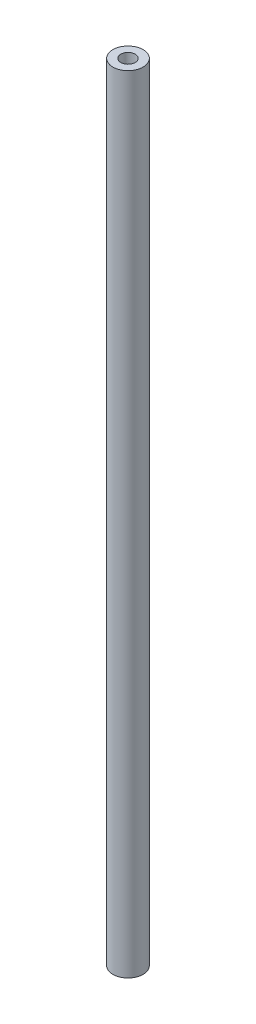
ISO-10303-21;
HEADER;
FILE_DESCRIPTION(('STEP AP214'),'2;1');
FILE_NAME('part.step','',(''),(''),'','','');
FILE_SCHEMA(('AUTOMOTIVE_DESIGN { 1 0 10303 214 1 1 1 1 }'));
ENDSEC;
DATA;
#1=APPLICATION_CONTEXT('core data for automotive mechanical design processes');
#2=APPLICATION_PROTOCOL_DEFINITION('international standard','automotive_design',2000,#1);
#3=PRODUCT_CONTEXT('',#1,'mechanical');
#4=PRODUCT('Part','Part','',(#3));
#5=PRODUCT_RELATED_PRODUCT_CATEGORY('part','',(#4));
#6=PRODUCT_DEFINITION_FORMATION('','',#4);
#7=PRODUCT_DEFINITION_CONTEXT('part definition',#1,'design');
#8=PRODUCT_DEFINITION('design','',#6,#7);
#9=PRODUCT_DEFINITION_SHAPE('','',#8);
#10=(LENGTH_UNIT() NAMED_UNIT(*) SI_UNIT(.MILLI.,.METRE.));
#11=(NAMED_UNIT(*) PLANE_ANGLE_UNIT() SI_UNIT($,.RADIAN.));
#12=(NAMED_UNIT(*) SI_UNIT($,.STERADIAN.) SOLID_ANGLE_UNIT());
#13=UNCERTAINTY_MEASURE_WITH_UNIT(LENGTH_MEASURE(1.E-05),#10,'distance_accuracy_value','');
#14=(GEOMETRIC_REPRESENTATION_CONTEXT(3) GLOBAL_UNCERTAINTY_ASSIGNED_CONTEXT((#13)) GLOBAL_UNIT_ASSIGNED_CONTEXT((#10,
#11,#12)) REPRESENTATION_CONTEXT('',''));
#15=CARTESIAN_POINT('',(0.,0.,0.));
#16=DIRECTION('',(0.,0.,1.));
#17=DIRECTION('',(1.,0.,0.));
#18=AXIS2_PLACEMENT_3D('',#15,#16,#17);
#19=CARTESIAN_POINT('',(0.,165.1,0.));
#20=DIRECTION('',(0.,1.,0.));
#21=DIRECTION('',(0.,0.,1.));
#22=AXIS2_PLACEMENT_3D('',#19,#20,#21);
#23=PLANE('',#22);
#24=CARTESIAN_POINT('',(0.,165.1,0.));
#25=DIRECTION('',(0.,1.,0.));
#26=DIRECTION('',(0.,0.,1.));
#27=AXIS2_PLACEMENT_3D('',#24,#25,#26);
#28=CIRCLE('',#27,3.175);
#29=CARTESIAN_POINT('',(0.,165.1,3.175));
#30=VERTEX_POINT('',#29);
#31=EDGE_CURVE('E10',#30,#30,#28,.T.);
#32=ORIENTED_EDGE('',*,*,#31,.T.);
#33=EDGE_LOOP('',(#32));
#34=FACE_BOUND('',#33,.T.);
#35=CARTESIAN_POINT('',(0.,165.1,0.));
#36=DIRECTION('',(0.,1.,0.));
#37=DIRECTION('',(0.,0.,1.));
#38=AXIS2_PLACEMENT_3D('',#35,#36,#37);
#39=CIRCLE('',#38,1.524);
#40=CARTESIAN_POINT('',(0.,165.1,1.524));
#41=VERTEX_POINT('',#40);
#42=EDGE_CURVE('E42',#41,#41,#39,.T.);
#43=ORIENTED_EDGE('',*,*,#42,.F.);
#44=EDGE_LOOP('',(#43));
#45=FACE_BOUND('',#44,.T.);
#46=ADVANCED_FACE('F31',(#34,#45),#23,.T.);
#47=CARTESIAN_POINT('',(0.,0.,0.));
#48=DIRECTION('',(0.,1.,0.));
#49=DIRECTION('',(0.,0.,1.));
#50=AXIS2_PLACEMENT_3D('',#47,#48,#49);
#51=PLANE('',#50);
#52=CARTESIAN_POINT('',(0.,0.,0.));
#53=DIRECTION('',(0.,1.,0.));
#54=DIRECTION('',(0.,0.,1.));
#55=AXIS2_PLACEMENT_3D('',#52,#53,#54);
#56=CIRCLE('',#55,3.175);
#57=CARTESIAN_POINT('',(0.,0.,3.175));
#58=VERTEX_POINT('',#57);
#59=EDGE_CURVE('E35',#58,#58,#56,.T.);
#60=ORIENTED_EDGE('',*,*,#59,.F.);
#61=EDGE_LOOP('',(#60));
#62=FACE_BOUND('',#61,.T.);
#63=CARTESIAN_POINT('',(0.,0.,0.));
#64=DIRECTION('',(0.,1.,0.));
#65=DIRECTION('',(0.,0.,1.));
#66=AXIS2_PLACEMENT_3D('',#63,#64,#65);
#67=CIRCLE('',#66,1.524);
#68=CARTESIAN_POINT('',(0.,0.,1.524));
#69=VERTEX_POINT('',#68);
#70=EDGE_CURVE('E44',#69,#69,#67,.T.);
#71=ORIENTED_EDGE('',*,*,#70,.T.);
#72=EDGE_LOOP('',(#71));
#73=FACE_BOUND('',#72,.T.);
#74=ADVANCED_FACE('F54',(#62,#73),#51,.F.);
#75=CARTESIAN_POINT('',(0.,165.1,0.));
#76=DIRECTION('',(0.,-1.,0.));
#77=DIRECTION('',(0.,0.,-1.));
#78=AXIS2_PLACEMENT_3D('',#75,#76,#77);
#79=CYLINDRICAL_SURFACE('',#78,3.175);
#80=ORIENTED_EDGE('',*,*,#31,.F.);
#81=EDGE_LOOP('',(#80));
#82=FACE_BOUND('',#81,.T.);
#83=ORIENTED_EDGE('',*,*,#59,.T.);
#84=EDGE_LOOP('',(#83));
#85=FACE_BOUND('',#84,.T.);
#86=ADVANCED_FACE('F33',(#82,#85),#79,.T.);
#87=CARTESIAN_POINT('',(0.,165.1,0.));
#88=DIRECTION('',(0.,-1.,0.));
#89=DIRECTION('',(0.,0.,-1.));
#90=AXIS2_PLACEMENT_3D('',#87,#88,#89);
#91=CYLINDRICAL_SURFACE('',#90,1.524);
#92=ORIENTED_EDGE('',*,*,#42,.T.);
#93=EDGE_LOOP('',(#92));
#94=FACE_BOUND('',#93,.T.);
#95=ORIENTED_EDGE('',*,*,#70,.F.);
#96=EDGE_LOOP('',(#95));
#97=FACE_BOUND('',#96,.T.);
#98=ADVANCED_FACE('F50',(#94,#97),#91,.F.);
#99=CLOSED_SHELL('',(#46,#74,#86,#98));
#100=MANIFOLD_SOLID_BREP('B2',#99);
#101=ADVANCED_BREP_SHAPE_REPRESENTATION('',(#18,#100),#14);
#102=SHAPE_DEFINITION_REPRESENTATION(#9,#101);
ENDSEC;
END-ISO-10303-21;
